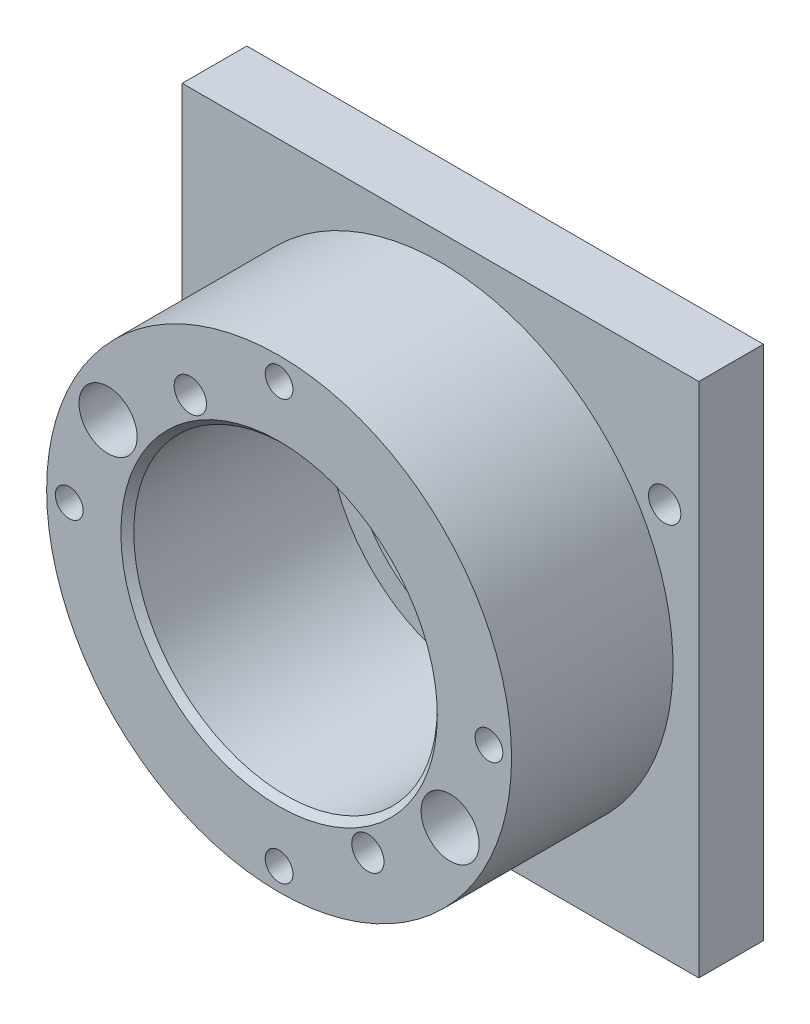
ISO-10303-21;
HEADER;
FILE_DESCRIPTION(('STEP AP214'),'2;1');
FILE_NAME('part.step','',(''),(''),'','','');
FILE_SCHEMA(('AUTOMOTIVE_DESIGN { 1 0 10303 214 1 1 1 1 }'));
ENDSEC;
DATA;
#1=APPLICATION_CONTEXT('core data for automotive mechanical design processes');
#2=APPLICATION_PROTOCOL_DEFINITION('international standard','automotive_design',2000,#1);
#3=PRODUCT_CONTEXT('',#1,'mechanical');
#4=PRODUCT('Part','Part','',(#3));
#5=PRODUCT_RELATED_PRODUCT_CATEGORY('part','',(#4));
#6=PRODUCT_DEFINITION_FORMATION('','',#4);
#7=PRODUCT_DEFINITION_CONTEXT('part definition',#1,'design');
#8=PRODUCT_DEFINITION('design','',#6,#7);
#9=PRODUCT_DEFINITION_SHAPE('','',#8);
#10=(LENGTH_UNIT() NAMED_UNIT(*) SI_UNIT(.MILLI.,.METRE.));
#11=(NAMED_UNIT(*) PLANE_ANGLE_UNIT() SI_UNIT($,.RADIAN.));
#12=(NAMED_UNIT(*) SI_UNIT($,.STERADIAN.) SOLID_ANGLE_UNIT());
#13=UNCERTAINTY_MEASURE_WITH_UNIT(LENGTH_MEASURE(1.E-05),#10,'distance_accuracy_value','');
#14=(GEOMETRIC_REPRESENTATION_CONTEXT(3) GLOBAL_UNCERTAINTY_ASSIGNED_CONTEXT((#13)) GLOBAL_UNIT_ASSIGNED_CONTEXT((#10,
#11,#12)) REPRESENTATION_CONTEXT('',''));
#15=CARTESIAN_POINT('',(0.,0.,0.));
#16=DIRECTION('',(0.,0.,1.));
#17=DIRECTION('',(1.,0.,0.));
#18=AXIS2_PLACEMENT_3D('',#15,#16,#17);
#19=CARTESIAN_POINT('',(0.,0.,0.));
#20=DIRECTION('',(0.,0.,-1.));
#21=DIRECTION('',(-1.,0.,0.));
#22=AXIS2_PLACEMENT_3D('',#19,#20,#21);
#23=PLANE('',#22);
#24=CARTESIAN_POINT('',(0.,0.,0.));
#25=DIRECTION('',(0.,0.,1.));
#26=DIRECTION('',(1.,0.,0.));
#27=AXIS2_PLACEMENT_3D('',#24,#25,#26);
#28=CIRCLE('',#27,20.1);
#29=CARTESIAN_POINT('',(20.1,0.,0.));
#30=VERTEX_POINT('',#29);
#31=EDGE_CURVE('E268',#30,#30,#28,.T.);
#32=ORIENTED_EDGE('',*,*,#31,.T.);
#33=EDGE_LOOP('',(#32));
#34=FACE_BOUND('',#33,.T.);
#35=CARTESIAN_POINT('',(0.,0.,0.));
#36=DIRECTION('',(0.,0.,-1.));
#37=DIRECTION('',(-1.,0.,0.));
#38=AXIS2_PLACEMENT_3D('',#35,#36,#37);
#39=CIRCLE('',#38,22.);
#40=CARTESIAN_POINT('',(-22.,0.,0.));
#41=VERTEX_POINT('',#40);
#42=EDGE_CURVE('E172',#41,#41,#39,.T.);
#43=ORIENTED_EDGE('',*,*,#42,.T.);
#44=EDGE_LOOP('',(#43));
#45=FACE_BOUND('',#44,.T.);
#46=ADVANCED_FACE('F34',(#34,#45),#23,.T.);
#47=CARTESIAN_POINT('',(0.,0.,0.));
#48=DIRECTION('',(0.,0.,1.));
#49=DIRECTION('',(1.,0.,0.));
#50=AXIS2_PLACEMENT_3D('',#47,#48,#49);
#51=CYLINDRICAL_SURFACE('',#50,20.1);
#52=ORIENTED_EDGE('',*,*,#31,.F.);
#53=EDGE_LOOP('',(#52));
#54=FACE_BOUND('',#53,.T.);
#55=CARTESIAN_POINT('',(0.,0.,4.));
#56=DIRECTION('',(0.,0.,1.));
#57=DIRECTION('',(1.,0.,0.));
#58=AXIS2_PLACEMENT_3D('',#55,#56,#57);
#59=CIRCLE('',#58,20.1);
#60=CARTESIAN_POINT('',(20.1,0.,4.));
#61=VERTEX_POINT('',#60);
#62=EDGE_CURVE('E186',#61,#61,#59,.T.);
#63=ORIENTED_EDGE('',*,*,#62,.T.);
#64=EDGE_LOOP('',(#63));
#65=FACE_BOUND('',#64,.T.);
#66=ADVANCED_FACE('F335',(#54,#65),#51,.F.);
#67=CARTESIAN_POINT('',(0.,0.,35.));
#68=DIRECTION('',(0.,0.,1.));
#69=DIRECTION('',(1.,0.,0.));
#70=AXIS2_PLACEMENT_3D('',#67,#68,#69);
#71=PLANE('',#70);
#72=CARTESIAN_POINT('',(-26.4884277857678,14.0841468835768,35.));
#73=DIRECTION('',(0.,0.,1.));
#74=DIRECTION('',(1.,0.,0.));
#75=AXIS2_PLACEMENT_3D('',#72,#73,#74);
#76=CIRCLE('',#75,4.5);
#77=CARTESIAN_POINT('',(-21.9884277857678,14.0841468835768,35.));
#78=VERTEX_POINT('',#77);
#79=EDGE_CURVE('E193',#78,#78,#76,.T.);
#80=ORIENTED_EDGE('',*,*,#79,.F.);
#81=EDGE_LOOP('',(#80));
#82=FACE_BOUND('',#81,.T.);
#83=CARTESIAN_POINT('',(26.4884277857678,-14.0841468835768,35.));
#84=DIRECTION('',(0.,0.,1.));
#85=DIRECTION('',(1.,0.,0.));
#86=AXIS2_PLACEMENT_3D('',#83,#84,#85);
#87=CIRCLE('',#86,4.5);
#88=CARTESIAN_POINT('',(30.9884277857678,-14.0841468835768,35.));
#89=VERTEX_POINT('',#88);
#90=EDGE_CURVE('E205',#89,#89,#87,.T.);
#91=ORIENTED_EDGE('',*,*,#90,.F.);
#92=EDGE_LOOP('',(#91));
#93=FACE_BOUND('',#92,.T.);
#94=CARTESIAN_POINT('',(13.7500000000001,-23.815698604072,35.));
#95=DIRECTION('',(0.,0.,-1.));
#96=DIRECTION('',(-1.,0.,0.));
#97=AXIS2_PLACEMENT_3D('',#94,#95,#96);
#98=CIRCLE('',#97,2.49999999999999);
#99=CARTESIAN_POINT('',(11.2500000000001,-23.815698604072,35.));
#100=VERTEX_POINT('',#99);
#101=EDGE_CURVE('E226',#100,#100,#98,.T.);
#102=ORIENTED_EDGE('',*,*,#101,.T.);
#103=EDGE_LOOP('',(#102));
#104=FACE_BOUND('',#103,.T.);
#105=CARTESIAN_POINT('',(0.,0.,35.));
#106=DIRECTION('',(0.,0.,1.));
#107=DIRECTION('',(1.,0.,0.));
#108=AXIS2_PLACEMENT_3D('',#105,#106,#107);
#109=CIRCLE('',#108,36.);
#110=CARTESIAN_POINT('',(36.,0.,35.));
#111=VERTEX_POINT('',#110);
#112=EDGE_CURVE('E265',#111,#111,#109,.T.);
#113=ORIENTED_EDGE('',*,*,#112,.T.);
#114=EDGE_LOOP('',(#113));
#115=FACE_BOUND('',#114,.T.);
#116=CARTESIAN_POINT('',(0.,32.5,35.));
#117=DIRECTION('',(0.,0.,1.));
#118=DIRECTION('',(1.,0.,0.));
#119=AXIS2_PLACEMENT_3D('',#116,#117,#118);
#120=CIRCLE('',#119,2.14999999999999);
#121=CARTESIAN_POINT('',(2.14999999999999,32.5,35.));
#122=VERTEX_POINT('',#121);
#123=EDGE_CURVE('E259',#122,#122,#120,.T.);
#124=ORIENTED_EDGE('',*,*,#123,.F.);
#125=EDGE_LOOP('',(#124));
#126=FACE_BOUND('',#125,.T.);
#127=CARTESIAN_POINT('',(32.5,-1.13473143512402E-13,35.));
#128=DIRECTION('',(0.,0.,1.));
#129=DIRECTION('',(1.,0.,0.));
#130=AXIS2_PLACEMENT_3D('',#127,#128,#129);
#131=CIRCLE('',#130,2.14999999999999);
#132=CARTESIAN_POINT('',(34.65,-1.13473143512402E-13,35.));
#133=VERTEX_POINT('',#132);
#134=EDGE_CURVE('E253',#133,#133,#131,.T.);
#135=ORIENTED_EDGE('',*,*,#134,.F.);
#136=EDGE_LOOP('',(#135));
#137=FACE_BOUND('',#136,.T.);
#138=CARTESIAN_POINT('',(0.,-32.5,35.));
#139=DIRECTION('',(0.,0.,1.));
#140=DIRECTION('',(1.,0.,0.));
#141=AXIS2_PLACEMENT_3D('',#138,#139,#140);
#142=CIRCLE('',#141,2.14999999999999);
#143=CARTESIAN_POINT('',(2.14999999999999,-32.5,35.));
#144=VERTEX_POINT('',#143);
#145=EDGE_CURVE('E247',#144,#144,#142,.T.);
#146=ORIENTED_EDGE('',*,*,#145,.F.);
#147=EDGE_LOOP('',(#146));
#148=FACE_BOUND('',#147,.T.);
#149=CARTESIAN_POINT('',(-32.5,3.40419430537206E-13,35.));
#150=DIRECTION('',(0.,0.,1.));
#151=DIRECTION('',(1.,0.,0.));
#152=AXIS2_PLACEMENT_3D('',#149,#150,#151);
#153=CIRCLE('',#152,2.14999999999999);
#154=CARTESIAN_POINT('',(-30.35,3.40419430537206E-13,35.));
#155=VERTEX_POINT('',#154);
#156=EDGE_CURVE('E241',#155,#155,#153,.T.);
#157=ORIENTED_EDGE('',*,*,#156,.F.);
#158=EDGE_LOOP('',(#157));
#159=FACE_BOUND('',#158,.T.);
#160=CARTESIAN_POINT('',(0.,0.,35.));
#161=DIRECTION('',(0.,0.,1.));
#162=DIRECTION('',(1.,0.,0.));
#163=AXIS2_PLACEMENT_3D('',#160,#161,#162);
#164=CIRCLE('',#163,24.5);
#165=CARTESIAN_POINT('',(24.5,0.,35.));
#166=VERTEX_POINT('',#165);
#167=EDGE_CURVE('E301',#166,#166,#164,.F.);
#168=ORIENTED_EDGE('',*,*,#167,.T.);
#169=EDGE_LOOP('',(#168));
#170=FACE_BOUND('',#169,.T.);
#171=CARTESIAN_POINT('',(-13.7500000000001,23.815698604072,35.));
#172=DIRECTION('',(0.,0.,-1.));
#173=DIRECTION('',(-1.,0.,0.));
#174=AXIS2_PLACEMENT_3D('',#171,#172,#173);
#175=CIRCLE('',#174,2.49999999999999);
#176=CARTESIAN_POINT('',(-16.2500000000001,23.815698604072,35.));
#177=VERTEX_POINT('',#176);
#178=EDGE_CURVE('E232',#177,#177,#175,.T.);
#179=ORIENTED_EDGE('',*,*,#178,.T.);
#180=EDGE_LOOP('',(#179));
#181=FACE_BOUND('',#180,.T.);
#182=ADVANCED_FACE('F341',(#82,#93,#104,#115,#126,#137,#148,#159,#170,#181),#71,.T.);
#183=CARTESIAN_POINT('',(0.,0.,10.));
#184=DIRECTION('',(0.,0.,-1.));
#185=DIRECTION('',(-1.,0.,0.));
#186=AXIS2_PLACEMENT_3D('',#183,#184,#185);
#187=PLANE('',#186);
#188=CARTESIAN_POINT('',(-34.7152756784355,-20.8590420338572,10.));
#189=DIRECTION('',(0.,0.,-1.));
#190=DIRECTION('',(-1.,0.,0.));
#191=AXIS2_PLACEMENT_3D('',#188,#189,#190);
#192=CIRCLE('',#191,2.49999999999999);
#193=CARTESIAN_POINT('',(-37.2152756784355,-20.8590420338572,10.));
#194=VERTEX_POINT('',#193);
#195=EDGE_CURVE('E220',#194,#194,#192,.T.);
#196=ORIENTED_EDGE('',*,*,#195,.T.);
#197=EDGE_LOOP('',(#196));
#198=FACE_BOUND('',#197,.T.);
#199=CARTESIAN_POINT('',(34.7152756784355,20.8590420338572,10.));
#200=DIRECTION('',(0.,0.,-1.));
#201=DIRECTION('',(-1.,0.,0.));
#202=AXIS2_PLACEMENT_3D('',#199,#200,#201);
#203=CIRCLE('',#202,2.49999999999999);
#204=CARTESIAN_POINT('',(32.2152756784355,20.8590420338572,10.));
#205=VERTEX_POINT('',#204);
#206=EDGE_CURVE('E238',#205,#205,#203,.T.);
#207=ORIENTED_EDGE('',*,*,#206,.T.);
#208=EDGE_LOOP('',(#207));
#209=FACE_BOUND('',#208,.T.);
#210=DIRECTION('',(0.,1.,0.));
#211=VECTOR('',#210,1.);
#212=CARTESIAN_POINT('',(-40.,-40.,10.));
#213=LINE('',#212,#211);
#214=CARTESIAN_POINT('',(-40.,-40.,10.));
#215=VERTEX_POINT('',#214);
#216=CARTESIAN_POINT('',(-40.,40.,10.));
#217=VERTEX_POINT('',#216);
#218=EDGE_CURVE('E272',#215,#217,#213,.T.);
#219=ORIENTED_EDGE('',*,*,#218,.F.);
#220=DIRECTION('',(1.,0.,0.));
#221=VECTOR('',#220,1.);
#222=CARTESIAN_POINT('',(-40.,-40.,10.));
#223=LINE('',#222,#221);
#224=CARTESIAN_POINT('',(40.,-40.,10.));
#225=VERTEX_POINT('',#224);
#226=EDGE_CURVE('E278',#215,#225,#223,.T.);
#227=ORIENTED_EDGE('',*,*,#226,.T.);
#228=DIRECTION('',(0.,1.,0.));
#229=VECTOR('',#228,1.);
#230=CARTESIAN_POINT('',(40.,-40.,10.));
#231=LINE('',#230,#229);
#232=CARTESIAN_POINT('',(40.,40.,10.));
#233=VERTEX_POINT('',#232);
#234=EDGE_CURVE('E276',#225,#233,#231,.T.);
#235=ORIENTED_EDGE('',*,*,#234,.T.);
#236=DIRECTION('',(1.,0.,0.));
#237=VECTOR('',#236,1.);
#238=CARTESIAN_POINT('',(-40.,40.,10.));
#239=LINE('',#238,#237);
#240=EDGE_CURVE('E274',#217,#233,#239,.T.);
#241=ORIENTED_EDGE('',*,*,#240,.F.);
#242=EDGE_LOOP('',(#219,#227,#235,#241));
#243=FACE_BOUND('',#242,.T.);
#244=CARTESIAN_POINT('',(0.,0.,10.));
#245=DIRECTION('',(0.,0.,-1.));
#246=DIRECTION('',(-1.,0.,0.));
#247=AXIS2_PLACEMENT_3D('',#244,#245,#246);
#248=CIRCLE('',#247,36.);
#249=CARTESIAN_POINT('',(-36.,0.,10.));
#250=VERTEX_POINT('',#249);
#251=EDGE_CURVE('E290',#250,#250,#248,.F.);
#252=ORIENTED_EDGE('',*,*,#251,.F.);
#253=EDGE_LOOP('',(#252));
#254=FACE_BOUND('',#253,.T.);
#255=ADVANCED_FACE('F367',(#198,#209,#243,#254),#187,.F.);
#256=CARTESIAN_POINT('',(-40.,-40.,10.));
#257=DIRECTION('',(-1.,0.,0.));
#258=DIRECTION('',(0.,0.,1.));
#259=AXIS2_PLACEMENT_3D('',#256,#257,#258);
#260=PLANE('',#259);
#261=DIRECTION('',(0.,1.,0.));
#262=VECTOR('',#261,1.);
#263=CARTESIAN_POINT('',(-40.,-40.,0.));
#264=LINE('',#263,#262);
#265=CARTESIAN_POINT('',(-40.,-40.,0.));
#266=VERTEX_POINT('',#265);
#267=CARTESIAN_POINT('',(-40.,40.,0.));
#268=VERTEX_POINT('',#267);
#269=EDGE_CURVE('E271',#266,#268,#264,.T.);
#270=ORIENTED_EDGE('',*,*,#269,.F.);
#271=DIRECTION('',(0.,0.,-1.));
#272=VECTOR('',#271,1.);
#273=CARTESIAN_POINT('',(-40.,-40.,10.));
#274=LINE('',#273,#272);
#275=EDGE_CURVE('E51',#215,#266,#274,.T.);
#276=ORIENTED_EDGE('',*,*,#275,.F.);
#277=ORIENTED_EDGE('',*,*,#218,.T.);
#278=DIRECTION('',(0.,0.,-1.));
#279=VECTOR('',#278,1.);
#280=CARTESIAN_POINT('',(-40.,40.,10.));
#281=LINE('',#280,#279);
#282=EDGE_CURVE('E77',#217,#268,#281,.T.);
#283=ORIENTED_EDGE('',*,*,#282,.T.);
#284=EDGE_LOOP('',(#270,#276,#277,#283));
#285=FACE_BOUND('',#284,.T.);
#286=ADVANCED_FACE('F365',(#285),#260,.T.);
#287=CARTESIAN_POINT('',(-40.,-40.,10.));
#288=DIRECTION('',(0.,1.,0.));
#289=DIRECTION('',(0.,0.,1.));
#290=AXIS2_PLACEMENT_3D('',#287,#288,#289);
#291=PLANE('',#290);
#292=DIRECTION('',(1.,0.,0.));
#293=VECTOR('',#292,1.);
#294=CARTESIAN_POINT('',(-40.,-40.,0.));
#295=LINE('',#294,#293);
#296=CARTESIAN_POINT('',(40.,-40.,0.));
#297=VERTEX_POINT('',#296);
#298=EDGE_CURVE('E69',#266,#297,#295,.T.);
#299=ORIENTED_EDGE('',*,*,#298,.T.);
#300=DIRECTION('',(0.,0.,-1.));
#301=VECTOR('',#300,1.);
#302=CARTESIAN_POINT('',(40.,-40.,10.));
#303=LINE('',#302,#301);
#304=EDGE_CURVE('E291',#225,#297,#303,.T.);
#305=ORIENTED_EDGE('',*,*,#304,.F.);
#306=ORIENTED_EDGE('',*,*,#226,.F.);
#307=ORIENTED_EDGE('',*,*,#275,.T.);
#308=EDGE_LOOP('',(#299,#305,#306,#307));
#309=FACE_BOUND('',#308,.T.);
#310=ADVANCED_FACE('F362',(#309),#291,.F.);
#311=CARTESIAN_POINT('',(40.,-40.,10.));
#312=DIRECTION('',(-1.,0.,0.));
#313=DIRECTION('',(0.,0.,1.));
#314=AXIS2_PLACEMENT_3D('',#311,#312,#313);
#315=PLANE('',#314);
#316=DIRECTION('',(0.,1.,0.));
#317=VECTOR('',#316,1.);
#318=CARTESIAN_POINT('',(40.,-40.,0.));
#319=LINE('',#318,#317);
#320=CARTESIAN_POINT('',(40.,40.,0.));
#321=VERTEX_POINT('',#320);
#322=EDGE_CURVE('E285',#297,#321,#319,.T.);
#323=ORIENTED_EDGE('',*,*,#322,.T.);
#324=DIRECTION('',(0.,0.,-1.));
#325=VECTOR('',#324,1.);
#326=CARTESIAN_POINT('',(40.,40.,10.));
#327=LINE('',#326,#325);
#328=EDGE_CURVE('E293',#233,#321,#327,.T.);
#329=ORIENTED_EDGE('',*,*,#328,.F.);
#330=ORIENTED_EDGE('',*,*,#234,.F.);
#331=ORIENTED_EDGE('',*,*,#304,.T.);
#332=EDGE_LOOP('',(#323,#329,#330,#331));
#333=FACE_BOUND('',#332,.T.);
#334=ADVANCED_FACE('F357',(#333),#315,.F.);
#335=CARTESIAN_POINT('',(-40.,40.,10.));
#336=DIRECTION('',(0.,1.,0.));
#337=DIRECTION('',(0.,0.,1.));
#338=AXIS2_PLACEMENT_3D('',#335,#336,#337);
#339=PLANE('',#338);
#340=DIRECTION('',(1.,0.,0.));
#341=VECTOR('',#340,1.);
#342=CARTESIAN_POINT('',(-40.,40.,0.));
#343=LINE('',#342,#341);
#344=EDGE_CURVE('E282',#268,#321,#343,.T.);
#345=ORIENTED_EDGE('',*,*,#344,.F.);
#346=ORIENTED_EDGE('',*,*,#282,.F.);
#347=ORIENTED_EDGE('',*,*,#240,.T.);
#348=ORIENTED_EDGE('',*,*,#328,.T.);
#349=EDGE_LOOP('',(#345,#346,#347,#348));
#350=FACE_BOUND('',#349,.T.);
#351=ADVANCED_FACE('F349',(#350),#339,.T.);
#352=CARTESIAN_POINT('',(-21.7880489405877,-8.80516458463748,0.));
#353=DIRECTION('',(0.,0.,-1.));
#354=DIRECTION('',(-1.,0.,0.));
#355=AXIS2_PLACEMENT_3D('',#352,#353,#354);
#356=CIRCLE('',#355,0.5);
#357=CARTESIAN_POINT('',(-22.2516244499619,-8.99250851197019,0.));
#358=VERTEX_POINT('',#357);
#359=CARTESIAN_POINT('',(-21.7880489405877,-8.30516458463748,0.));
#360=VERTEX_POINT('',#359);
#361=EDGE_CURVE('E129',#358,#360,#356,.T.);
#362=ORIENTED_EDGE('',*,*,#361,.F.);
#363=CARTESIAN_POINT('',(0.,0.,0.));
#364=DIRECTION('',(0.,0.,-1.));
#365=DIRECTION('',(-1.,0.,0.));
#366=AXIS2_PLACEMENT_3D('',#363,#364,#365);
#367=CIRCLE('',#366,24.);
#368=CARTESIAN_POINT('',(-22.2455635373229,9.0074914880298,0.));
#369=VERTEX_POINT('',#368);
#370=EDGE_CURVE('E180',#369,#358,#367,.T.);
#371=ORIENTED_EDGE('',*,*,#370,.F.);
#372=CARTESIAN_POINT('',(-21.782114296962,8.81983541536252,0.));
#373=DIRECTION('',(0.,0.,-1.));
#374=DIRECTION('',(-1.,0.,0.));
#375=AXIS2_PLACEMENT_3D('',#372,#373,#374);
#376=CIRCLE('',#375,0.499999999999997);
#377=CARTESIAN_POINT('',(-21.782114296962,8.31983541536252,0.));
#378=VERTEX_POINT('',#377);
#379=EDGE_CURVE('E166',#378,#369,#376,.T.);
#380=ORIENTED_EDGE('',*,*,#379,.F.);
#381=DIRECTION('',(-1.,0.,0.));
#382=VECTOR('',#381,1.);
#383=CARTESIAN_POINT('',(-21.782114296962,8.31983541536252,0.));
#384=LINE('',#383,#382);
#385=CARTESIAN_POINT('',(-21.4484236195141,8.31983541536252,0.));
#386=VERTEX_POINT('',#385);
#387=EDGE_CURVE('E158',#386,#378,#384,.T.);
#388=ORIENTED_EDGE('',*,*,#387,.F.);
#389=CARTESIAN_POINT('',(-0.00302913677552662,0.00749185414424393,0.));
#390=DIRECTION('',(0.,0.,-1.));
#391=DIRECTION('',(-1.,0.,0.));
#392=AXIS2_PLACEMENT_3D('',#389,#390,#391);
#393=CIRCLE('',#392,23.);
#394=CARTESIAN_POINT('',(-21.4483023439599,-8.30516458463748,0.));
#395=VERTEX_POINT('',#394);
#396=EDGE_CURVE('E153',#395,#386,#393,.T.);
#397=ORIENTED_EDGE('',*,*,#396,.F.);
#398=DIRECTION('',(1.,0.,0.));
#399=VECTOR('',#398,1.);
#400=CARTESIAN_POINT('',(-21.431430131102,-8.30516458463748,0.));
#401=LINE('',#400,#399);
#402=EDGE_CURVE('E139',#360,#395,#401,.T.);
#403=ORIENTED_EDGE('',*,*,#402,.F.);
#404=EDGE_LOOP('',(#362,#371,#380,#388,#397,#403));
#405=FACE_BOUND('',#404,.T.);
#406=CARTESIAN_POINT('',(-26.4884277857678,14.0841468835768,0.));
#407=DIRECTION('',(0.,0.,1.));
#408=DIRECTION('',(1.,0.,0.));
#409=AXIS2_PLACEMENT_3D('',#406,#407,#408);
#410=CIRCLE('',#409,2.49999999999999);
#411=CARTESIAN_POINT('',(-23.9884277857678,14.0841468835768,0.));
#412=VERTEX_POINT('',#411);
#413=EDGE_CURVE('E202',#412,#412,#410,.T.);
#414=ORIENTED_EDGE('',*,*,#413,.T.);
#415=EDGE_LOOP('',(#414));
#416=FACE_BOUND('',#415,.T.);
#417=CARTESIAN_POINT('',(26.4884277857678,-14.0841468835768,0.));
#418=DIRECTION('',(0.,0.,1.));
#419=DIRECTION('',(1.,0.,0.));
#420=AXIS2_PLACEMENT_3D('',#417,#418,#419);
#421=CIRCLE('',#420,2.49999999999999);
#422=CARTESIAN_POINT('',(28.9884277857678,-14.0841468835768,0.));
#423=VERTEX_POINT('',#422);
#424=EDGE_CURVE('E214',#423,#423,#421,.T.);
#425=ORIENTED_EDGE('',*,*,#424,.T.);
#426=EDGE_LOOP('',(#425));
#427=FACE_BOUND('',#426,.T.);
#428=CARTESIAN_POINT('',(-34.7152756784355,-20.8590420338572,0.));
#429=DIRECTION('',(0.,0.,-1.));
#430=DIRECTION('',(-1.,0.,0.));
#431=AXIS2_PLACEMENT_3D('',#428,#429,#430);
#432=CIRCLE('',#431,2.5);
#433=CARTESIAN_POINT('',(-37.2152756784355,-20.8590420338572,0.));
#434=VERTEX_POINT('',#433);
#435=EDGE_CURVE('E217',#434,#434,#432,.T.);
#436=ORIENTED_EDGE('',*,*,#435,.F.);
#437=EDGE_LOOP('',(#436));
#438=FACE_BOUND('',#437,.T.);
#439=CARTESIAN_POINT('',(13.7500000000001,-23.815698604072,0.));
#440=DIRECTION('',(0.,0.,-1.));
#441=DIRECTION('',(-1.,0.,0.));
#442=AXIS2_PLACEMENT_3D('',#439,#440,#441);
#443=CIRCLE('',#442,2.5);
#444=CARTESIAN_POINT('',(11.2500000000001,-23.815698604072,0.));
#445=VERTEX_POINT('',#444);
#446=EDGE_CURVE('E223',#445,#445,#443,.T.);
#447=ORIENTED_EDGE('',*,*,#446,.F.);
#448=EDGE_LOOP('',(#447));
#449=FACE_BOUND('',#448,.T.);
#450=CARTESIAN_POINT('',(-13.7500000000001,23.815698604072,0.));
#451=DIRECTION('',(0.,0.,-1.));
#452=DIRECTION('',(-1.,0.,0.));
#453=AXIS2_PLACEMENT_3D('',#450,#451,#452);
#454=CIRCLE('',#453,2.5);
#455=CARTESIAN_POINT('',(-16.2500000000001,23.815698604072,0.));
#456=VERTEX_POINT('',#455);
#457=EDGE_CURVE('E229',#456,#456,#454,.T.);
#458=ORIENTED_EDGE('',*,*,#457,.F.);
#459=EDGE_LOOP('',(#458));
#460=FACE_BOUND('',#459,.T.);
#461=CARTESIAN_POINT('',(34.7152756784355,20.8590420338572,0.));
#462=DIRECTION('',(0.,0.,-1.));
#463=DIRECTION('',(-1.,0.,0.));
#464=AXIS2_PLACEMENT_3D('',#461,#462,#463);
#465=CIRCLE('',#464,2.5);
#466=CARTESIAN_POINT('',(32.2152756784355,20.8590420338572,0.));
#467=VERTEX_POINT('',#466);
#468=EDGE_CURVE('E235',#467,#467,#465,.T.);
#469=ORIENTED_EDGE('',*,*,#468,.F.);
#470=EDGE_LOOP('',(#469));
#471=FACE_BOUND('',#470,.T.);
#472=ORIENTED_EDGE('',*,*,#269,.T.);
#473=ORIENTED_EDGE('',*,*,#344,.T.);
#474=ORIENTED_EDGE('',*,*,#322,.F.);
#475=ORIENTED_EDGE('',*,*,#298,.F.);
#476=EDGE_LOOP('',(#472,#473,#474,#475));
#477=FACE_BOUND('',#476,.T.);
#478=ADVANCED_FACE('F150',(#405,#416,#427,#438,#449,#460,#471,#477),#23,.T.);
#479=CARTESIAN_POINT('',(0.,0.,35.));
#480=DIRECTION('',(0.,0.,-1.));
#481=DIRECTION('',(-1.,0.,0.));
#482=AXIS2_PLACEMENT_3D('',#479,#480,#481);
#483=CYLINDRICAL_SURFACE('',#482,36.);
#484=ORIENTED_EDGE('',*,*,#112,.F.);
#485=EDGE_LOOP('',(#484));
#486=FACE_BOUND('',#485,.T.);
#487=ORIENTED_EDGE('',*,*,#251,.T.);
#488=EDGE_LOOP('',(#487));
#489=FACE_BOUND('',#488,.T.);
#490=ADVANCED_FACE('F348',(#486,#489),#483,.T.);
#491=CARTESIAN_POINT('',(0.,0.,35.));
#492=DIRECTION('',(0.,0.,-1.));
#493=DIRECTION('',(-1.,0.,0.));
#494=AXIS2_PLACEMENT_3D('',#491,#492,#493);
#495=CYLINDRICAL_SURFACE('',#494,23.5);
#496=CARTESIAN_POINT('',(0.,0.,34.));
#497=DIRECTION('',(0.,0.,1.));
#498=DIRECTION('',(1.,0.,0.));
#499=AXIS2_PLACEMENT_3D('',#496,#497,#498);
#500=CIRCLE('',#499,23.5);
#501=CARTESIAN_POINT('',(23.5,0.,34.));
#502=VERTEX_POINT('',#501);
#503=EDGE_CURVE('E298',#502,#502,#500,.T.);
#504=ORIENTED_EDGE('',*,*,#503,.T.);
#505=EDGE_LOOP('',(#504));
#506=FACE_BOUND('',#505,.T.);
#507=CARTESIAN_POINT('',(0.,0.,4.));
#508=DIRECTION('',(0.,0.,1.));
#509=DIRECTION('',(1.,0.,0.));
#510=AXIS2_PLACEMENT_3D('',#507,#508,#509);
#511=CIRCLE('',#510,23.5);
#512=CARTESIAN_POINT('',(23.5,0.,4.));
#513=VERTEX_POINT('',#512);
#514=EDGE_CURVE('E190',#513,#513,#511,.T.);
#515=ORIENTED_EDGE('',*,*,#514,.F.);
#516=EDGE_LOOP('',(#515));
#517=FACE_BOUND('',#516,.T.);
#518=ADVANCED_FACE('F354',(#506,#517),#495,.F.);
#519=CARTESIAN_POINT('',(0.,32.5,20.));
#520=DIRECTION('',(0.,0.,1.));
#521=DIRECTION('',(1.,0.,0.));
#522=AXIS2_PLACEMENT_3D('',#519,#520,#521);
#523=CONICAL_SURFACE('',#522,2.15,1.02974425867665);
#524=CARTESIAN_POINT('',(0.,32.5,18.7081496690908));
#525=VERTEX_POINT('',#524);
#526=VERTEX_LOOP('',#525);
#527=FACE_BOUND('',#526,.T.);
#528=CARTESIAN_POINT('',(0.,32.5,20.));
#529=DIRECTION('',(0.,0.,1.));
#530=DIRECTION('',(1.,0.,0.));
#531=AXIS2_PLACEMENT_3D('',#528,#529,#530);
#532=CIRCLE('',#531,2.15);
#533=CARTESIAN_POINT('',(2.15,32.5,20.));
#534=VERTEX_POINT('',#533);
#535=EDGE_CURVE('E262',#534,#534,#532,.T.);
#536=ORIENTED_EDGE('',*,*,#535,.T.);
#537=EDGE_LOOP('',(#536));
#538=FACE_BOUND('',#537,.T.);
#539=ADVANCED_FACE('F391',(#527,#538),#523,.F.);
#540=CARTESIAN_POINT('',(0.,32.5,35.));
#541=DIRECTION('',(0.,0.,1.));
#542=DIRECTION('',(1.,0.,0.));
#543=AXIS2_PLACEMENT_3D('',#540,#541,#542);
#544=CYLINDRICAL_SURFACE('',#543,2.14999999999999);
#545=ORIENTED_EDGE('',*,*,#535,.F.);
#546=EDGE_LOOP('',(#545));
#547=FACE_BOUND('',#546,.T.);
#548=ORIENTED_EDGE('',*,*,#123,.T.);
#549=EDGE_LOOP('',(#548));
#550=FACE_BOUND('',#549,.T.);
#551=ADVANCED_FACE('F395',(#547,#550),#544,.F.);
#552=CARTESIAN_POINT('',(32.5,-1.13473143512402E-13,20.));
#553=DIRECTION('',(0.,0.,1.));
#554=DIRECTION('',(1.,0.,0.));
#555=AXIS2_PLACEMENT_3D('',#552,#553,#554);
#556=CONICAL_SURFACE('',#555,2.14999999999999,1.02974425867665);
#557=CARTESIAN_POINT('',(32.5,-1.13473143512402E-13,18.7081496690908));
#558=VERTEX_POINT('',#557);
#559=VERTEX_LOOP('',#558);
#560=FACE_BOUND('',#559,.T.);
#561=CARTESIAN_POINT('',(32.5,-1.13473143512402E-13,20.));
#562=DIRECTION('',(0.,0.,1.));
#563=DIRECTION('',(1.,0.,0.));
#564=AXIS2_PLACEMENT_3D('',#561,#562,#563);
#565=CIRCLE('',#564,2.14999999999999);
#566=CARTESIAN_POINT('',(34.65,-1.13473143512402E-13,20.));
#567=VERTEX_POINT('',#566);
#568=EDGE_CURVE('E256',#567,#567,#565,.T.);
#569=ORIENTED_EDGE('',*,*,#568,.T.);
#570=EDGE_LOOP('',(#569));
#571=FACE_BOUND('',#570,.T.);
#572=ADVANCED_FACE('F399',(#560,#571),#556,.F.);
#573=CARTESIAN_POINT('',(32.5,-1.13473143512402E-13,35.));
#574=DIRECTION('',(0.,0.,1.));
#575=DIRECTION('',(1.,0.,0.));
#576=AXIS2_PLACEMENT_3D('',#573,#574,#575);
#577=CYLINDRICAL_SURFACE('',#576,2.14999999999999);
#578=ORIENTED_EDGE('',*,*,#568,.F.);
#579=EDGE_LOOP('',(#578));
#580=FACE_BOUND('',#579,.T.);
#581=ORIENTED_EDGE('',*,*,#134,.T.);
#582=EDGE_LOOP('',(#581));
#583=FACE_BOUND('',#582,.T.);
#584=ADVANCED_FACE('F403',(#580,#583),#577,.F.);
#585=CARTESIAN_POINT('',(0.,-32.5,20.));
#586=DIRECTION('',(0.,0.,1.));
#587=DIRECTION('',(1.,0.,0.));
#588=AXIS2_PLACEMENT_3D('',#585,#586,#587);
#589=CONICAL_SURFACE('',#588,2.15,1.02974425867665);
#590=CARTESIAN_POINT('',(0.,-32.5,18.7081496690908));
#591=VERTEX_POINT('',#590);
#592=VERTEX_LOOP('',#591);
#593=FACE_BOUND('',#592,.T.);
#594=CARTESIAN_POINT('',(0.,-32.5,20.));
#595=DIRECTION('',(0.,0.,1.));
#596=DIRECTION('',(1.,0.,0.));
#597=AXIS2_PLACEMENT_3D('',#594,#595,#596);
#598=CIRCLE('',#597,2.15);
#599=CARTESIAN_POINT('',(2.15,-32.5,20.));
#600=VERTEX_POINT('',#599);
#601=EDGE_CURVE('E250',#600,#600,#598,.T.);
#602=ORIENTED_EDGE('',*,*,#601,.T.);
#603=EDGE_LOOP('',(#602));
#604=FACE_BOUND('',#603,.T.);
#605=ADVANCED_FACE('F407',(#593,#604),#589,.F.);
#606=CARTESIAN_POINT('',(0.,-32.5,35.));
#607=DIRECTION('',(0.,0.,1.));
#608=DIRECTION('',(1.,0.,0.));
#609=AXIS2_PLACEMENT_3D('',#606,#607,#608);
#610=CYLINDRICAL_SURFACE('',#609,2.14999999999999);
#611=ORIENTED_EDGE('',*,*,#601,.F.);
#612=EDGE_LOOP('',(#611));
#613=FACE_BOUND('',#612,.T.);
#614=ORIENTED_EDGE('',*,*,#145,.T.);
#615=EDGE_LOOP('',(#614));
#616=FACE_BOUND('',#615,.T.);
#617=ADVANCED_FACE('F411',(#613,#616),#610,.F.);
#618=CARTESIAN_POINT('',(-32.5,3.40419430537206E-13,20.));
#619=DIRECTION('',(0.,0.,1.));
#620=DIRECTION('',(1.,0.,0.));
#621=AXIS2_PLACEMENT_3D('',#618,#619,#620);
#622=CONICAL_SURFACE('',#621,2.15,1.02974425867665);
#623=CARTESIAN_POINT('',(-32.5,3.40419430537206E-13,18.7081496690908));
#624=VERTEX_POINT('',#623);
#625=VERTEX_LOOP('',#624);
#626=FACE_BOUND('',#625,.T.);
#627=CARTESIAN_POINT('',(-32.5,3.40419430537206E-13,20.));
#628=DIRECTION('',(0.,0.,1.));
#629=DIRECTION('',(1.,0.,0.));
#630=AXIS2_PLACEMENT_3D('',#627,#628,#629);
#631=CIRCLE('',#630,2.15);
#632=CARTESIAN_POINT('',(-30.35,3.40419430537206E-13,20.));
#633=VERTEX_POINT('',#632);
#634=EDGE_CURVE('E244',#633,#633,#631,.T.);
#635=ORIENTED_EDGE('',*,*,#634,.T.);
#636=EDGE_LOOP('',(#635));
#637=FACE_BOUND('',#636,.T.);
#638=ADVANCED_FACE('F415',(#626,#637),#622,.F.);
#639=CARTESIAN_POINT('',(-32.5,3.40419430537206E-13,35.));
#640=DIRECTION('',(0.,0.,1.));
#641=DIRECTION('',(1.,0.,0.));
#642=AXIS2_PLACEMENT_3D('',#639,#640,#641);
#643=CYLINDRICAL_SURFACE('',#642,2.14999999999999);
#644=ORIENTED_EDGE('',*,*,#634,.F.);
#645=EDGE_LOOP('',(#644));
#646=FACE_BOUND('',#645,.T.);
#647=ORIENTED_EDGE('',*,*,#156,.T.);
#648=EDGE_LOOP('',(#647));
#649=FACE_BOUND('',#648,.T.);
#650=ADVANCED_FACE('F419',(#646,#649),#643,.F.);
#651=CARTESIAN_POINT('',(0.,0.,34.));
#652=DIRECTION('',(0.,0.,1.));
#653=DIRECTION('',(1.,0.,0.));
#654=AXIS2_PLACEMENT_3D('',#651,#652,#653);
#655=CONICAL_SURFACE('',#654,23.5,0.785398163397448);
#656=ORIENTED_EDGE('',*,*,#167,.F.);
#657=EDGE_LOOP('',(#656));
#658=FACE_BOUND('',#657,.T.);
#659=ORIENTED_EDGE('',*,*,#503,.F.);
#660=EDGE_LOOP('',(#659));
#661=FACE_BOUND('',#660,.T.);
#662=ADVANCED_FACE('F36',(#658,#661),#655,.F.);
#663=CARTESIAN_POINT('',(34.7152756784355,20.8590420338572,0.));
#664=DIRECTION('',(0.,0.,-1.));
#665=DIRECTION('',(-1.,0.,0.));
#666=AXIS2_PLACEMENT_3D('',#663,#664,#665);
#667=CYLINDRICAL_SURFACE('',#666,2.49999999999999);
#668=ORIENTED_EDGE('',*,*,#468,.T.);
#669=EDGE_LOOP('',(#668));
#670=FACE_BOUND('',#669,.T.);
#671=ORIENTED_EDGE('',*,*,#206,.F.);
#672=EDGE_LOOP('',(#671));
#673=FACE_BOUND('',#672,.T.);
#674=ADVANCED_FACE('F424',(#670,#673),#667,.F.);
#675=CARTESIAN_POINT('',(-13.7500000000001,23.815698604072,0.));
#676=DIRECTION('',(0.,0.,-1.));
#677=DIRECTION('',(-1.,0.,0.));
#678=AXIS2_PLACEMENT_3D('',#675,#676,#677);
#679=CYLINDRICAL_SURFACE('',#678,2.49999999999999);
#680=ORIENTED_EDGE('',*,*,#178,.F.);
#681=EDGE_LOOP('',(#680));
#682=FACE_BOUND('',#681,.T.);
#683=ORIENTED_EDGE('',*,*,#457,.T.);
#684=EDGE_LOOP('',(#683));
#685=FACE_BOUND('',#684,.T.);
#686=ADVANCED_FACE('F427',(#682,#685),#679,.F.);
#687=CARTESIAN_POINT('',(13.7500000000001,-23.815698604072,0.));
#688=DIRECTION('',(0.,0.,-1.));
#689=DIRECTION('',(-1.,0.,0.));
#690=AXIS2_PLACEMENT_3D('',#687,#688,#689);
#691=CYLINDRICAL_SURFACE('',#690,2.49999999999999);
#692=ORIENTED_EDGE('',*,*,#101,.F.);
#693=EDGE_LOOP('',(#692));
#694=FACE_BOUND('',#693,.T.);
#695=ORIENTED_EDGE('',*,*,#446,.T.);
#696=EDGE_LOOP('',(#695));
#697=FACE_BOUND('',#696,.T.);
#698=ADVANCED_FACE('F431',(#694,#697),#691,.F.);
#699=CARTESIAN_POINT('',(-34.7152756784355,-20.8590420338572,0.));
#700=DIRECTION('',(0.,0.,-1.));
#701=DIRECTION('',(-1.,0.,0.));
#702=AXIS2_PLACEMENT_3D('',#699,#700,#701);
#703=CYLINDRICAL_SURFACE('',#702,2.49999999999999);
#704=ORIENTED_EDGE('',*,*,#435,.T.);
#705=EDGE_LOOP('',(#704));
#706=FACE_BOUND('',#705,.T.);
#707=ORIENTED_EDGE('',*,*,#195,.F.);
#708=EDGE_LOOP('',(#707));
#709=FACE_BOUND('',#708,.T.);
#710=ADVANCED_FACE('F435',(#706,#709),#703,.F.);
#711=CARTESIAN_POINT('',(26.4884277857678,-14.0841468835768,35.));
#712=DIRECTION('',(0.,0.,1.));
#713=DIRECTION('',(1.,0.,0.));
#714=AXIS2_PLACEMENT_3D('',#711,#712,#713);
#715=CYLINDRICAL_SURFACE('',#714,2.5);
#716=ORIENTED_EDGE('',*,*,#424,.F.);
#717=EDGE_LOOP('',(#716));
#718=FACE_BOUND('',#717,.T.);
#719=CARTESIAN_POINT('',(26.4884277857678,-14.0841468835768,28.));
#720=DIRECTION('',(0.,0.,1.));
#721=DIRECTION('',(1.,0.,0.));
#722=AXIS2_PLACEMENT_3D('',#719,#720,#721);
#723=CIRCLE('',#722,2.5);
#724=CARTESIAN_POINT('',(28.9884277857678,-14.0841468835768,28.));
#725=VERTEX_POINT('',#724);
#726=EDGE_CURVE('E211',#725,#725,#723,.T.);
#727=ORIENTED_EDGE('',*,*,#726,.T.);
#728=EDGE_LOOP('',(#727));
#729=FACE_BOUND('',#728,.T.);
#730=ADVANCED_FACE('F439',(#718,#729),#715,.F.);
#731=CARTESIAN_POINT('',(28.9884277857678,-14.0841468835768,28.));
#732=DIRECTION('',(0.,0.,-1.));
#733=DIRECTION('',(-1.,0.,0.));
#734=AXIS2_PLACEMENT_3D('',#731,#732,#733);
#735=PLANE('',#734);
#736=ORIENTED_EDGE('',*,*,#726,.F.);
#737=EDGE_LOOP('',(#736));
#738=FACE_BOUND('',#737,.T.);
#739=CARTESIAN_POINT('',(26.4884277857678,-14.0841468835768,28.));
#740=DIRECTION('',(0.,0.,1.));
#741=DIRECTION('',(1.,0.,0.));
#742=AXIS2_PLACEMENT_3D('',#739,#740,#741);
#743=CIRCLE('',#742,4.5);
#744=CARTESIAN_POINT('',(30.9884277857678,-14.0841468835768,28.));
#745=VERTEX_POINT('',#744);
#746=EDGE_CURVE('E208',#745,#745,#743,.T.);
#747=ORIENTED_EDGE('',*,*,#746,.T.);
#748=EDGE_LOOP('',(#747));
#749=FACE_BOUND('',#748,.T.);
#750=ADVANCED_FACE('F443',(#738,#749),#735,.F.);
#751=CARTESIAN_POINT('',(26.4884277857678,-14.0841468835768,35.));
#752=DIRECTION('',(0.,0.,1.));
#753=DIRECTION('',(1.,0.,0.));
#754=AXIS2_PLACEMENT_3D('',#751,#752,#753);
#755=CYLINDRICAL_SURFACE('',#754,4.5);
#756=ORIENTED_EDGE('',*,*,#746,.F.);
#757=EDGE_LOOP('',(#756));
#758=FACE_BOUND('',#757,.T.);
#759=ORIENTED_EDGE('',*,*,#90,.T.);
#760=EDGE_LOOP('',(#759));
#761=FACE_BOUND('',#760,.T.);
#762=ADVANCED_FACE('F447',(#758,#761),#755,.F.);
#763=CARTESIAN_POINT('',(-26.4884277857678,14.0841468835768,35.));
#764=DIRECTION('',(0.,0.,1.));
#765=DIRECTION('',(1.,0.,0.));
#766=AXIS2_PLACEMENT_3D('',#763,#764,#765);
#767=CYLINDRICAL_SURFACE('',#766,2.5);
#768=ORIENTED_EDGE('',*,*,#413,.F.);
#769=EDGE_LOOP('',(#768));
#770=FACE_BOUND('',#769,.T.);
#771=CARTESIAN_POINT('',(-26.4884277857678,14.0841468835768,28.));
#772=DIRECTION('',(0.,0.,1.));
#773=DIRECTION('',(1.,0.,0.));
#774=AXIS2_PLACEMENT_3D('',#771,#772,#773);
#775=CIRCLE('',#774,2.5);
#776=CARTESIAN_POINT('',(-23.9884277857678,14.0841468835768,28.));
#777=VERTEX_POINT('',#776);
#778=EDGE_CURVE('E199',#777,#777,#775,.T.);
#779=ORIENTED_EDGE('',*,*,#778,.T.);
#780=EDGE_LOOP('',(#779));
#781=FACE_BOUND('',#780,.T.);
#782=ADVANCED_FACE('F451',(#770,#781),#767,.F.);
#783=CARTESIAN_POINT('',(-23.9884277857678,14.0841468835768,28.));
#784=DIRECTION('',(0.,0.,-1.));
#785=DIRECTION('',(-1.,0.,0.));
#786=AXIS2_PLACEMENT_3D('',#783,#784,#785);
#787=PLANE('',#786);
#788=ORIENTED_EDGE('',*,*,#778,.F.);
#789=EDGE_LOOP('',(#788));
#790=FACE_BOUND('',#789,.T.);
#791=CARTESIAN_POINT('',(-26.4884277857678,14.0841468835768,28.));
#792=DIRECTION('',(0.,0.,1.));
#793=DIRECTION('',(1.,0.,0.));
#794=AXIS2_PLACEMENT_3D('',#791,#792,#793);
#795=CIRCLE('',#794,4.5);
#796=CARTESIAN_POINT('',(-21.9884277857678,14.0841468835768,28.));
#797=VERTEX_POINT('',#796);
#798=EDGE_CURVE('E196',#797,#797,#795,.T.);
#799=ORIENTED_EDGE('',*,*,#798,.T.);
#800=EDGE_LOOP('',(#799));
#801=FACE_BOUND('',#800,.T.);
#802=ADVANCED_FACE('F455',(#790,#801),#787,.F.);
#803=CARTESIAN_POINT('',(-26.4884277857678,14.0841468835768,35.));
#804=DIRECTION('',(0.,0.,1.));
#805=DIRECTION('',(1.,0.,0.));
#806=AXIS2_PLACEMENT_3D('',#803,#804,#805);
#807=CYLINDRICAL_SURFACE('',#806,4.5);
#808=ORIENTED_EDGE('',*,*,#798,.F.);
#809=EDGE_LOOP('',(#808));
#810=FACE_BOUND('',#809,.T.);
#811=ORIENTED_EDGE('',*,*,#79,.T.);
#812=EDGE_LOOP('',(#811));
#813=FACE_BOUND('',#812,.T.);
#814=ADVANCED_FACE('F459',(#810,#813),#807,.F.);
#815=CARTESIAN_POINT('',(0.,0.,4.));
#816=DIRECTION('',(0.,0.,1.));
#817=DIRECTION('',(1.,0.,0.));
#818=AXIS2_PLACEMENT_3D('',#815,#816,#817);
#819=PLANE('',#818);
#820=ORIENTED_EDGE('',*,*,#62,.F.);
#821=EDGE_LOOP('',(#820));
#822=FACE_BOUND('',#821,.T.);
#823=ORIENTED_EDGE('',*,*,#514,.T.);
#824=EDGE_LOOP('',(#823));
#825=FACE_BOUND('',#824,.T.);
#826=ADVANCED_FACE('F463',(#822,#825),#819,.T.);
#827=CARTESIAN_POINT('',(0.,0.,2.));
#828=DIRECTION('',(0.,0.,-1.));
#829=DIRECTION('',(-1.,0.,0.));
#830=AXIS2_PLACEMENT_3D('',#827,#828,#829);
#831=CYLINDRICAL_SURFACE('',#830,24.);
#832=ORIENTED_EDGE('',*,*,#370,.T.);
#833=DIRECTION('',(0.,0.,1.));
#834=VECTOR('',#833,1.);
#835=CARTESIAN_POINT('',(-22.2516244499619,-8.99250851197019,-18.2212605909851));
#836=LINE('',#835,#834);
#837=CARTESIAN_POINT('',(-22.2516244499619,-8.99250851197019,2.));
#838=VERTEX_POINT('',#837);
#839=EDGE_CURVE('E134',#358,#838,#836,.T.);
#840=ORIENTED_EDGE('',*,*,#839,.T.);
#841=CARTESIAN_POINT('',(0.,0.,2.));
#842=DIRECTION('',(0.,0.,-1.));
#843=DIRECTION('',(-1.,0.,0.));
#844=AXIS2_PLACEMENT_3D('',#841,#842,#843);
#845=CIRCLE('',#844,24.);
#846=CARTESIAN_POINT('',(-22.2455635373229,9.0074914880298,2.));
#847=VERTEX_POINT('',#846);
#848=EDGE_CURVE('E183',#847,#838,#845,.T.);
#849=ORIENTED_EDGE('',*,*,#848,.F.);
#850=DIRECTION('',(0.,0.,1.));
#851=VECTOR('',#850,1.);
#852=CARTESIAN_POINT('',(-22.2455635373229,9.0074914880298,-18.2212605909851));
#853=LINE('',#852,#851);
#854=EDGE_CURVE('E173',#369,#847,#853,.T.);
#855=ORIENTED_EDGE('',*,*,#854,.F.);
#856=EDGE_LOOP('',(#832,#840,#849,#855));
#857=FACE_BOUND('',#856,.T.);
#858=ADVANCED_FACE('F318',(#857),#831,.F.);
#859=CARTESIAN_POINT('',(0.,0.,2.));
#860=DIRECTION('',(0.,0.,-1.));
#861=DIRECTION('',(-1.,0.,0.));
#862=AXIS2_PLACEMENT_3D('',#859,#860,#861);
#863=PLANE('',#862);
#864=ORIENTED_EDGE('',*,*,#848,.T.);
#865=CARTESIAN_POINT('',(-21.7880489405877,-8.80516458463748,2.));
#866=DIRECTION('',(0.,0.,-1.));
#867=DIRECTION('',(-1.,0.,0.));
#868=AXIS2_PLACEMENT_3D('',#865,#866,#867);
#869=CIRCLE('',#868,0.5);
#870=CARTESIAN_POINT('',(-21.7880489405877,-8.30516458463748,2.));
#871=VERTEX_POINT('',#870);
#872=EDGE_CURVE('E147',#871,#838,#869,.F.);
#873=ORIENTED_EDGE('',*,*,#872,.F.);
#874=DIRECTION('',(-1.,0.,0.));
#875=VECTOR('',#874,1.);
#876=CARTESIAN_POINT('',(-21.431430131102,-8.30516458463748,2.));
#877=LINE('',#876,#875);
#878=CARTESIAN_POINT('',(-21.4483023439599,-8.30516458463748,2.));
#879=VERTEX_POINT('',#878);
#880=EDGE_CURVE('E145',#879,#871,#877,.T.);
#881=ORIENTED_EDGE('',*,*,#880,.F.);
#882=CARTESIAN_POINT('',(-0.00302913677552662,0.00749185414424393,2.));
#883=DIRECTION('',(0.,0.,-1.));
#884=DIRECTION('',(-1.,0.,0.));
#885=AXIS2_PLACEMENT_3D('',#882,#883,#884);
#886=CIRCLE('',#885,23.);
#887=CARTESIAN_POINT('',(-21.4484236195141,8.31983541536252,2.));
#888=VERTEX_POINT('',#887);
#889=EDGE_CURVE('E170',#879,#888,#886,.T.);
#890=ORIENTED_EDGE('',*,*,#889,.T.);
#891=DIRECTION('',(1.,0.,0.));
#892=VECTOR('',#891,1.);
#893=CARTESIAN_POINT('',(-21.782114296962,8.31983541536252,2.));
#894=LINE('',#893,#892);
#895=CARTESIAN_POINT('',(-21.782114296962,8.31983541536252,2.));
#896=VERTEX_POINT('',#895);
#897=EDGE_CURVE('E159',#896,#888,#894,.T.);
#898=ORIENTED_EDGE('',*,*,#897,.F.);
#899=CARTESIAN_POINT('',(-21.782114296962,8.81983541536252,2.));
#900=DIRECTION('',(0.,0.,-1.));
#901=DIRECTION('',(-1.,0.,0.));
#902=AXIS2_PLACEMENT_3D('',#899,#900,#901);
#903=CIRCLE('',#902,0.499999999999997);
#904=EDGE_CURVE('E162',#847,#896,#903,.F.);
#905=ORIENTED_EDGE('',*,*,#904,.F.);
#906=EDGE_LOOP('',(#864,#873,#881,#890,#898,#905));
#907=FACE_BOUND('',#906,.T.);
#908=CARTESIAN_POINT('',(0.,0.,2.));
#909=DIRECTION('',(0.,0.,-1.));
#910=DIRECTION('',(-1.,0.,0.));
#911=AXIS2_PLACEMENT_3D('',#908,#909,#910);
#912=CIRCLE('',#911,22.);
#913=CARTESIAN_POINT('',(-22.,0.,2.));
#914=VERTEX_POINT('',#913);
#915=EDGE_CURVE('E177',#914,#914,#912,.T.);
#916=ORIENTED_EDGE('',*,*,#915,.F.);
#917=EDGE_LOOP('',(#916));
#918=FACE_BOUND('',#917,.T.);
#919=ADVANCED_FACE('F320',(#907,#918),#863,.T.);
#920=CARTESIAN_POINT('',(0.,0.,2.));
#921=DIRECTION('',(0.,0.,-1.));
#922=DIRECTION('',(-1.,0.,0.));
#923=AXIS2_PLACEMENT_3D('',#920,#921,#922);
#924=CYLINDRICAL_SURFACE('',#923,22.);
#925=ORIENTED_EDGE('',*,*,#915,.T.);
#926=EDGE_LOOP('',(#925));
#927=FACE_BOUND('',#926,.T.);
#928=ORIENTED_EDGE('',*,*,#42,.F.);
#929=EDGE_LOOP('',(#928));
#930=FACE_BOUND('',#929,.T.);
#931=ADVANCED_FACE('F324',(#927,#930),#924,.T.);
#932=CARTESIAN_POINT('',(-0.00302913677552662,0.00749185414424393,-18.2212605909851));
#933=DIRECTION('',(0.,0.,1.));
#934=DIRECTION('',(1.,0.,0.));
#935=AXIS2_PLACEMENT_3D('',#932,#933,#934);
#936=CYLINDRICAL_SURFACE('',#935,23.);
#937=DIRECTION('',(0.,0.,1.));
#938=VECTOR('',#937,1.);
#939=CARTESIAN_POINT('',(-21.4483023439599,-8.30516458463748,-18.2212605909851));
#940=LINE('',#939,#938);
#941=EDGE_CURVE('E11',#395,#879,#940,.T.);
#942=ORIENTED_EDGE('',*,*,#941,.F.);
#943=ORIENTED_EDGE('',*,*,#396,.T.);
#944=DIRECTION('',(0.,0.,1.));
#945=VECTOR('',#944,1.);
#946=CARTESIAN_POINT('',(-21.4484236195141,8.31983541536252,-18.2212605909851));
#947=LINE('',#946,#945);
#948=EDGE_CURVE('E43',#888,#386,#947,.F.);
#949=ORIENTED_EDGE('',*,*,#948,.F.);
#950=ORIENTED_EDGE('',*,*,#889,.F.);
#951=EDGE_LOOP('',(#942,#943,#949,#950));
#952=FACE_BOUND('',#951,.T.);
#953=ADVANCED_FACE('F322',(#952),#936,.F.);
#954=CARTESIAN_POINT('',(-21.782114296962,8.81983541536252,3.50072722242346));
#955=DIRECTION('',(0.,0.,-1.));
#956=DIRECTION('',(-1.,0.,0.));
#957=AXIS2_PLACEMENT_3D('',#954,#955,#956);
#958=CYLINDRICAL_SURFACE('',#957,0.499999999999997);
#959=ORIENTED_EDGE('',*,*,#904,.T.);
#960=DIRECTION('',(0.,0.,-1.));
#961=VECTOR('',#960,1.);
#962=CARTESIAN_POINT('',(-21.782114296962,8.31983541536252,3.50072722242346));
#963=LINE('',#962,#961);
#964=EDGE_CURVE('E163',#896,#378,#963,.T.);
#965=ORIENTED_EDGE('',*,*,#964,.T.);
#966=ORIENTED_EDGE('',*,*,#379,.T.);
#967=ORIENTED_EDGE('',*,*,#854,.T.);
#968=EDGE_LOOP('',(#959,#965,#966,#967));
#969=FACE_BOUND('',#968,.T.);
#970=ADVANCED_FACE('F314',(#969),#958,.F.);
#971=CARTESIAN_POINT('',(-21.782114296962,8.31983541536252,3.50072722242346));
#972=DIRECTION('',(0.,-1.,0.));
#973=DIRECTION('',(0.,0.,-1.));
#974=AXIS2_PLACEMENT_3D('',#971,#972,#973);
#975=PLANE('',#974);
#976=ORIENTED_EDGE('',*,*,#948,.T.);
#977=ORIENTED_EDGE('',*,*,#387,.T.);
#978=ORIENTED_EDGE('',*,*,#964,.F.);
#979=ORIENTED_EDGE('',*,*,#897,.T.);
#980=EDGE_LOOP('',(#976,#977,#978,#979));
#981=FACE_BOUND('',#980,.T.);
#982=ADVANCED_FACE('F306',(#981),#975,.F.);
#983=CARTESIAN_POINT('',(-21.7880489405877,-8.80516458463748,3.50072722242346));
#984=DIRECTION('',(0.,0.,-1.));
#985=DIRECTION('',(-1.,0.,0.));
#986=AXIS2_PLACEMENT_3D('',#983,#984,#985);
#987=CYLINDRICAL_SURFACE('',#986,0.5);
#988=ORIENTED_EDGE('',*,*,#839,.F.);
#989=ORIENTED_EDGE('',*,*,#361,.T.);
#990=DIRECTION('',(0.,0.,-1.));
#991=VECTOR('',#990,1.);
#992=CARTESIAN_POINT('',(-21.7880489405877,-8.30516458463748,3.50072722242346));
#993=LINE('',#992,#991);
#994=EDGE_CURVE('E132',#871,#360,#993,.T.);
#995=ORIENTED_EDGE('',*,*,#994,.F.);
#996=ORIENTED_EDGE('',*,*,#872,.T.);
#997=EDGE_LOOP('',(#988,#989,#995,#996));
#998=FACE_BOUND('',#997,.T.);
#999=ADVANCED_FACE('F131',(#998),#987,.F.);
#1000=CARTESIAN_POINT('',(-21.431430131102,-8.30516458463748,3.50072722242346));
#1001=DIRECTION('',(0.,1.,0.));
#1002=DIRECTION('',(-1.,0.,0.));
#1003=AXIS2_PLACEMENT_3D('',#1000,#1001,#1002);
#1004=PLANE('',#1003);
#1005=ORIENTED_EDGE('',*,*,#941,.T.);
#1006=ORIENTED_EDGE('',*,*,#880,.T.);
#1007=ORIENTED_EDGE('',*,*,#994,.T.);
#1008=ORIENTED_EDGE('',*,*,#402,.T.);
#1009=EDGE_LOOP('',(#1005,#1006,#1007,#1008));
#1010=FACE_BOUND('',#1009,.T.);
#1011=ADVANCED_FACE('F142',(#1010),#1004,.F.);
#1012=CLOSED_SHELL('',(#46,#66,#182,#255,#286,#310,#334,#351,#478,#490,#518,#539,#551,#572,#584,
#605,#617,#638,#650,#662,#674,#686,#698,#710,#730,#750,#762,#782,#802,#814,#826,#858,#919,#931,
#953,#970,#982,#999,#1011));
#1013=MANIFOLD_SOLID_BREP('B2',#1012);
#1014=ADVANCED_BREP_SHAPE_REPRESENTATION('',(#18,#1013),#14);
#1015=SHAPE_DEFINITION_REPRESENTATION(#9,#1014);
ENDSEC;
END-ISO-10303-21;
